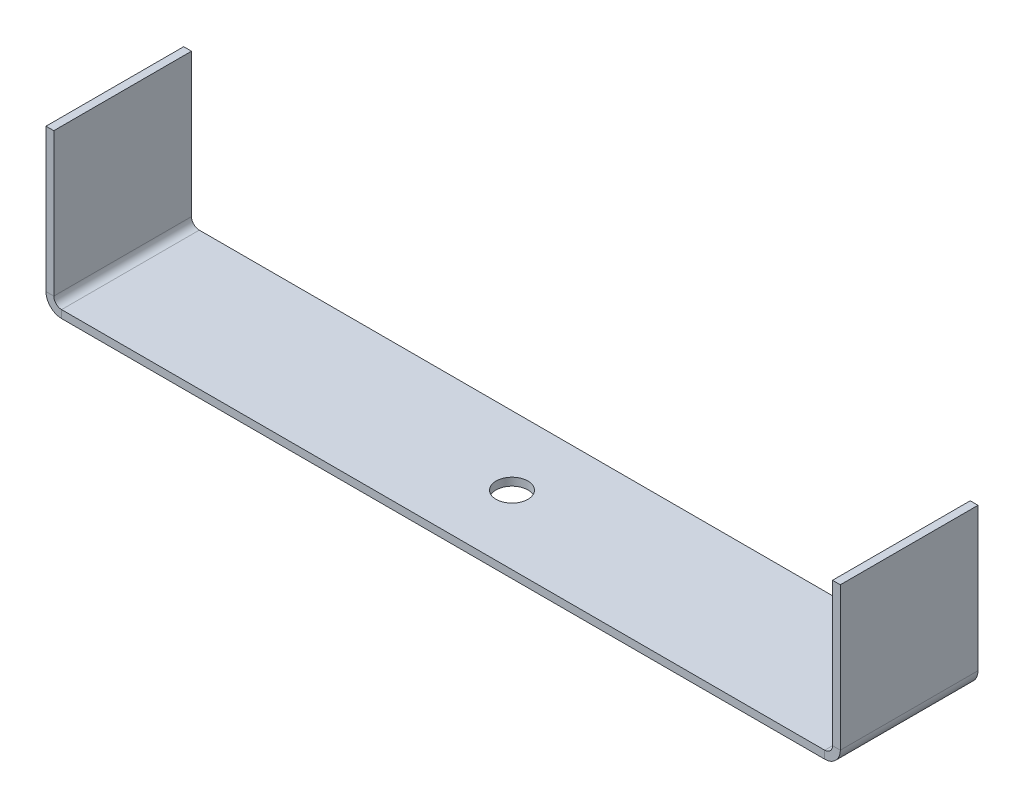
ISO-10303-21;
HEADER;
FILE_DESCRIPTION(('STEP AP214'),'2;1');
FILE_NAME('part.step','',(''),(''),'','','');
FILE_SCHEMA(('AUTOMOTIVE_DESIGN { 1 0 10303 214 1 1 1 1 }'));
ENDSEC;
DATA;
#1=APPLICATION_CONTEXT('core data for automotive mechanical design processes');
#2=APPLICATION_PROTOCOL_DEFINITION('international standard','automotive_design',2000,#1);
#3=PRODUCT_CONTEXT('',#1,'mechanical');
#4=PRODUCT('Part','Part','',(#3));
#5=PRODUCT_RELATED_PRODUCT_CATEGORY('part','',(#4));
#6=PRODUCT_DEFINITION_FORMATION('','',#4);
#7=PRODUCT_DEFINITION_CONTEXT('part definition',#1,'design');
#8=PRODUCT_DEFINITION('design','',#6,#7);
#9=PRODUCT_DEFINITION_SHAPE('','',#8);
#10=(LENGTH_UNIT() NAMED_UNIT(*) SI_UNIT(.MILLI.,.METRE.));
#11=(NAMED_UNIT(*) PLANE_ANGLE_UNIT() SI_UNIT($,.RADIAN.));
#12=(NAMED_UNIT(*) SI_UNIT($,.STERADIAN.) SOLID_ANGLE_UNIT());
#13=UNCERTAINTY_MEASURE_WITH_UNIT(LENGTH_MEASURE(1.E-05),#10,'distance_accuracy_value','');
#14=(GEOMETRIC_REPRESENTATION_CONTEXT(3) GLOBAL_UNCERTAINTY_ASSIGNED_CONTEXT((#13)) GLOBAL_UNIT_ASSIGNED_CONTEXT((#10,
#11,#12)) REPRESENTATION_CONTEXT('',''));
#15=CARTESIAN_POINT('',(0.,0.,0.));
#16=DIRECTION('',(0.,0.,1.));
#17=DIRECTION('',(1.,0.,0.));
#18=AXIS2_PLACEMENT_3D('',#15,#16,#17);
#19=CARTESIAN_POINT('',(36.0268,0.,6.5));
#20=DIRECTION('',(0.,0.,1.));
#21=DIRECTION('',(1.,0.,0.));
#22=AXIS2_PLACEMENT_3D('',#19,#20,#21);
#23=PLANE('',#22);
#24=DIRECTION('',(0.,1.,0.));
#25=VECTOR('',#24,1.);
#26=CARTESIAN_POINT('',(36.0268,0.,6.5));
#27=LINE('',#26,#25);
#28=CARTESIAN_POINT('',(36.0268,0.,6.5));
#29=VERTEX_POINT('',#28);
#30=CARTESIAN_POINT('',(36.0268,0.736600000000014,6.5));
#31=VERTEX_POINT('',#30);
#32=EDGE_CURVE('E11',#29,#31,#27,.T.);
#33=ORIENTED_EDGE('',*,*,#32,.F.);
#34=CARTESIAN_POINT('',(36.0268,1.47320000000001,6.5));
#35=DIRECTION('',(0.,0.,1.));
#36=DIRECTION('',(1.,0.,0.));
#37=AXIS2_PLACEMENT_3D('',#34,#35,#36);
#38=CIRCLE('',#37,1.4732);
#39=CARTESIAN_POINT('',(37.5,1.47320000000001,6.5));
#40=VERTEX_POINT('',#39);
#41=EDGE_CURVE('E247',#40,#29,#38,.F.);
#42=ORIENTED_EDGE('',*,*,#41,.F.);
#43=DIRECTION('',(1.,0.,0.));
#44=VECTOR('',#43,1.);
#45=CARTESIAN_POINT('',(36.7634,1.47320000000001,6.5));
#46=LINE('',#45,#44);
#47=CARTESIAN_POINT('',(36.7634,1.47320000000001,6.5));
#48=VERTEX_POINT('',#47);
#49=EDGE_CURVE('E44',#48,#40,#46,.T.);
#50=ORIENTED_EDGE('',*,*,#49,.F.);
#51=CARTESIAN_POINT('',(36.0268,1.47320000000001,6.5));
#52=DIRECTION('',(0.,0.,1.));
#53=DIRECTION('',(1.,0.,0.));
#54=AXIS2_PLACEMENT_3D('',#51,#52,#53);
#55=CIRCLE('',#54,0.7366);
#56=EDGE_CURVE('E145',#48,#31,#55,.F.);
#57=ORIENTED_EDGE('',*,*,#56,.T.);
#58=EDGE_LOOP('',(#33,#42,#50,#57));
#59=FACE_BOUND('',#58,.T.);
#60=ADVANCED_FACE('F36',(#59),#23,.T.);
#61=CARTESIAN_POINT('',(36.7634,1.47320000000001,6.5));
#62=DIRECTION('',(0.,0.,1.));
#63=DIRECTION('',(1.,0.,0.));
#64=AXIS2_PLACEMENT_3D('',#61,#62,#63);
#65=PLANE('',#64);
#66=DIRECTION('',(-1.,0.,0.));
#67=VECTOR('',#66,1.);
#68=CARTESIAN_POINT('',(-37.5,0.,6.5));
#69=LINE('',#68,#67);
#70=CARTESIAN_POINT('',(-36.0268,0.,6.5));
#71=VERTEX_POINT('',#70);
#72=EDGE_CURVE('E139',#29,#71,#69,.T.);
#73=ORIENTED_EDGE('',*,*,#72,.F.);
#74=ORIENTED_EDGE('',*,*,#32,.T.);
#75=DIRECTION('',(-1.,0.,0.));
#76=VECTOR('',#75,1.);
#77=CARTESIAN_POINT('',(-37.5,0.7366,6.5));
#78=LINE('',#77,#76);
#79=CARTESIAN_POINT('',(-36.0268,0.7366,6.5));
#80=VERTEX_POINT('',#79);
#81=EDGE_CURVE('E136',#31,#80,#78,.T.);
#82=ORIENTED_EDGE('',*,*,#81,.T.);
#83=DIRECTION('',(0.,-1.,0.));
#84=VECTOR('',#83,1.);
#85=CARTESIAN_POINT('',(-36.0268,0.7366,6.5));
#86=LINE('',#85,#84);
#87=EDGE_CURVE('E228',#80,#71,#86,.T.);
#88=ORIENTED_EDGE('',*,*,#87,.T.);
#89=EDGE_LOOP('',(#73,#74,#82,#88));
#90=FACE_BOUND('',#89,.T.);
#91=ADVANCED_FACE('F134',(#90),#65,.T.);
#92=CARTESIAN_POINT('',(37.5,1.47320000000001,-6.5));
#93=DIRECTION('',(0.,0.,-1.));
#94=DIRECTION('',(-1.,0.,0.));
#95=AXIS2_PLACEMENT_3D('',#92,#93,#94);
#96=PLANE('',#95);
#97=DIRECTION('',(-1.,0.,0.));
#98=VECTOR('',#97,1.);
#99=CARTESIAN_POINT('',(37.5,1.47320000000001,-6.5));
#100=LINE('',#99,#98);
#101=CARTESIAN_POINT('',(37.5,1.47320000000001,-6.5));
#102=VERTEX_POINT('',#101);
#103=CARTESIAN_POINT('',(36.7634,1.47320000000001,-6.5));
#104=VERTEX_POINT('',#103);
#105=EDGE_CURVE('E233',#102,#104,#100,.T.);
#106=ORIENTED_EDGE('',*,*,#105,.F.);
#107=CARTESIAN_POINT('',(36.0268,1.47320000000001,-6.5));
#108=DIRECTION('',(0.,0.,1.));
#109=DIRECTION('',(1.,0.,0.));
#110=AXIS2_PLACEMENT_3D('',#107,#108,#109);
#111=CIRCLE('',#110,1.4732);
#112=CARTESIAN_POINT('',(36.0268,0.,-6.5));
#113=VERTEX_POINT('',#112);
#114=EDGE_CURVE('E185',#102,#113,#111,.F.);
#115=ORIENTED_EDGE('',*,*,#114,.T.);
#116=DIRECTION('',(0.,-1.,0.));
#117=VECTOR('',#116,1.);
#118=CARTESIAN_POINT('',(36.0268,0.736600000000014,-6.5));
#119=LINE('',#118,#117);
#120=CARTESIAN_POINT('',(36.0268,0.736600000000014,-6.5));
#121=VERTEX_POINT('',#120);
#122=EDGE_CURVE('E231',#121,#113,#119,.T.);
#123=ORIENTED_EDGE('',*,*,#122,.F.);
#124=CARTESIAN_POINT('',(36.0268,1.47320000000001,-6.5));
#125=DIRECTION('',(0.,0.,1.));
#126=DIRECTION('',(1.,0.,0.));
#127=AXIS2_PLACEMENT_3D('',#124,#125,#126);
#128=CIRCLE('',#127,0.7366);
#129=EDGE_CURVE('E157',#104,#121,#128,.F.);
#130=ORIENTED_EDGE('',*,*,#129,.F.);
#131=EDGE_LOOP('',(#106,#115,#123,#130));
#132=FACE_BOUND('',#131,.T.);
#133=ADVANCED_FACE('F290',(#132),#96,.T.);
#134=CARTESIAN_POINT('',(36.0268,0.736600000000014,-6.5));
#135=DIRECTION('',(0.,0.,-1.));
#136=DIRECTION('',(-1.,0.,0.));
#137=AXIS2_PLACEMENT_3D('',#134,#135,#136);
#138=PLANE('',#137);
#139=DIRECTION('',(0.,-1.,0.));
#140=VECTOR('',#139,1.);
#141=CARTESIAN_POINT('',(37.5,0.,-6.5));
#142=LINE('',#141,#140);
#143=CARTESIAN_POINT('',(37.5,15.,-6.5));
#144=VERTEX_POINT('',#143);
#145=EDGE_CURVE('E188',#144,#102,#142,.T.);
#146=ORIENTED_EDGE('',*,*,#145,.T.);
#147=ORIENTED_EDGE('',*,*,#105,.T.);
#148=DIRECTION('',(0.,1.,0.));
#149=VECTOR('',#148,1.);
#150=CARTESIAN_POINT('',(36.7634,0.,-6.5));
#151=LINE('',#150,#149);
#152=CARTESIAN_POINT('',(36.7634,15.,-6.5));
#153=VERTEX_POINT('',#152);
#154=EDGE_CURVE('E194',#153,#104,#151,.F.);
#155=ORIENTED_EDGE('',*,*,#154,.F.);
#156=DIRECTION('',(1.,0.,0.));
#157=VECTOR('',#156,1.);
#158=CARTESIAN_POINT('',(36.7634,15.,-6.5));
#159=LINE('',#158,#157);
#160=EDGE_CURVE('E191',#153,#144,#159,.T.);
#161=ORIENTED_EDGE('',*,*,#160,.T.);
#162=EDGE_LOOP('',(#146,#147,#155,#161));
#163=FACE_BOUND('',#162,.T.);
#164=ADVANCED_FACE('F294',(#163),#138,.T.);
#165=CARTESIAN_POINT('',(-37.5,1.4732,6.5));
#166=DIRECTION('',(0.,0.,1.));
#167=DIRECTION('',(1.,0.,0.));
#168=AXIS2_PLACEMENT_3D('',#165,#166,#167);
#169=PLANE('',#168);
#170=DIRECTION('',(1.,0.,0.));
#171=VECTOR('',#170,1.);
#172=CARTESIAN_POINT('',(-37.5,1.4732,6.5));
#173=LINE('',#172,#171);
#174=CARTESIAN_POINT('',(-37.5,1.4732,6.5));
#175=VERTEX_POINT('',#174);
#176=CARTESIAN_POINT('',(-36.7634,1.4732,6.5));
#177=VERTEX_POINT('',#176);
#178=EDGE_CURVE('E52',#175,#177,#173,.T.);
#179=ORIENTED_EDGE('',*,*,#178,.F.);
#180=CARTESIAN_POINT('',(-36.0268,1.4732,6.5));
#181=DIRECTION('',(0.,0.,1.));
#182=DIRECTION('',(1.,0.,0.));
#183=AXIS2_PLACEMENT_3D('',#180,#181,#182);
#184=CIRCLE('',#183,1.4732);
#185=EDGE_CURVE('E257',#71,#175,#184,.F.);
#186=ORIENTED_EDGE('',*,*,#185,.F.);
#187=ORIENTED_EDGE('',*,*,#87,.F.);
#188=CARTESIAN_POINT('',(-36.0268,1.4732,6.5));
#189=DIRECTION('',(0.,0.,1.));
#190=DIRECTION('',(1.,0.,0.));
#191=AXIS2_PLACEMENT_3D('',#188,#189,#190);
#192=CIRCLE('',#191,0.7366);
#193=EDGE_CURVE('E165',#80,#177,#192,.F.);
#194=ORIENTED_EDGE('',*,*,#193,.T.);
#195=EDGE_LOOP('',(#179,#186,#187,#194));
#196=FACE_BOUND('',#195,.T.);
#197=ADVANCED_FACE('F300',(#196),#169,.T.);
#198=CARTESIAN_POINT('',(-36.0268,0.7366,6.5));
#199=DIRECTION('',(0.,0.,1.));
#200=DIRECTION('',(1.,0.,0.));
#201=AXIS2_PLACEMENT_3D('',#198,#199,#200);
#202=PLANE('',#201);
#203=DIRECTION('',(0.,1.,0.));
#204=VECTOR('',#203,1.);
#205=CARTESIAN_POINT('',(-37.5,0.,6.5));
#206=LINE('',#205,#204);
#207=CARTESIAN_POINT('',(-37.5,15.,6.5));
#208=VERTEX_POINT('',#207);
#209=EDGE_CURVE('E260',#175,#208,#206,.T.);
#210=ORIENTED_EDGE('',*,*,#209,.F.);
#211=ORIENTED_EDGE('',*,*,#178,.T.);
#212=DIRECTION('',(0.,1.,0.));
#213=VECTOR('',#212,1.);
#214=CARTESIAN_POINT('',(-36.7634,0.,6.5));
#215=LINE('',#214,#213);
#216=CARTESIAN_POINT('',(-36.7634,15.,6.5));
#217=VERTEX_POINT('',#216);
#218=EDGE_CURVE('E106',#177,#217,#215,.T.);
#219=ORIENTED_EDGE('',*,*,#218,.T.);
#220=DIRECTION('',(1.,0.,0.));
#221=VECTOR('',#220,1.);
#222=CARTESIAN_POINT('',(-37.5,15.,6.5));
#223=LINE('',#222,#221);
#224=EDGE_CURVE('E263',#208,#217,#223,.T.);
#225=ORIENTED_EDGE('',*,*,#224,.F.);
#226=EDGE_LOOP('',(#210,#211,#219,#225));
#227=FACE_BOUND('',#226,.T.);
#228=ADVANCED_FACE('F304',(#227),#202,.T.);
#229=CARTESIAN_POINT('',(-36.0268,0.,-6.5));
#230=DIRECTION('',(0.,0.,-1.));
#231=DIRECTION('',(-1.,0.,0.));
#232=AXIS2_PLACEMENT_3D('',#229,#230,#231);
#233=PLANE('',#232);
#234=DIRECTION('',(0.,1.,0.));
#235=VECTOR('',#234,1.);
#236=CARTESIAN_POINT('',(-36.0268,0.,-6.5));
#237=LINE('',#236,#235);
#238=CARTESIAN_POINT('',(-36.0268,0.,-6.5));
#239=VERTEX_POINT('',#238);
#240=CARTESIAN_POINT('',(-36.0268,0.7366,-6.5));
#241=VERTEX_POINT('',#240);
#242=EDGE_CURVE('E93',#239,#241,#237,.T.);
#243=ORIENTED_EDGE('',*,*,#242,.F.);
#244=CARTESIAN_POINT('',(-36.0268,1.4732,-6.5));
#245=DIRECTION('',(0.,0.,1.));
#246=DIRECTION('',(1.,0.,0.));
#247=AXIS2_PLACEMENT_3D('',#244,#245,#246);
#248=CIRCLE('',#247,1.4732);
#249=CARTESIAN_POINT('',(-37.5,1.4732,-6.5));
#250=VERTEX_POINT('',#249);
#251=EDGE_CURVE('E181',#239,#250,#248,.F.);
#252=ORIENTED_EDGE('',*,*,#251,.T.);
#253=DIRECTION('',(-1.,0.,0.));
#254=VECTOR('',#253,1.);
#255=CARTESIAN_POINT('',(-36.7634,1.4732,-6.5));
#256=LINE('',#255,#254);
#257=CARTESIAN_POINT('',(-36.7634,1.4732,-6.5));
#258=VERTEX_POINT('',#257);
#259=EDGE_CURVE('E100',#258,#250,#256,.T.);
#260=ORIENTED_EDGE('',*,*,#259,.F.);
#261=CARTESIAN_POINT('',(-36.0268,1.4732,-6.5));
#262=DIRECTION('',(0.,0.,1.));
#263=DIRECTION('',(1.,0.,0.));
#264=AXIS2_PLACEMENT_3D('',#261,#262,#263);
#265=CIRCLE('',#264,0.7366);
#266=EDGE_CURVE('E200',#241,#258,#265,.F.);
#267=ORIENTED_EDGE('',*,*,#266,.F.);
#268=EDGE_LOOP('',(#243,#252,#260,#267));
#269=FACE_BOUND('',#268,.T.);
#270=ADVANCED_FACE('F308',(#269),#233,.T.);
#271=CARTESIAN_POINT('',(-36.7634,1.4732,-6.5));
#272=DIRECTION('',(0.,0.,-1.));
#273=DIRECTION('',(-1.,0.,0.));
#274=AXIS2_PLACEMENT_3D('',#271,#272,#273);
#275=PLANE('',#274);
#276=DIRECTION('',(-1.,0.,0.));
#277=VECTOR('',#276,1.);
#278=CARTESIAN_POINT('',(-37.5,0.,-6.5));
#279=LINE('',#278,#277);
#280=EDGE_CURVE('E183',#113,#239,#279,.T.);
#281=ORIENTED_EDGE('',*,*,#280,.T.);
#282=ORIENTED_EDGE('',*,*,#242,.T.);
#283=DIRECTION('',(-1.,0.,0.));
#284=VECTOR('',#283,1.);
#285=CARTESIAN_POINT('',(-37.5,0.7366,-6.5));
#286=LINE('',#285,#284);
#287=EDGE_CURVE('E198',#121,#241,#286,.T.);
#288=ORIENTED_EDGE('',*,*,#287,.F.);
#289=ORIENTED_EDGE('',*,*,#122,.T.);
#290=EDGE_LOOP('',(#281,#282,#288,#289));
#291=FACE_BOUND('',#290,.T.);
#292=ADVANCED_FACE('F311',(#291),#275,.T.);
#293=CARTESIAN_POINT('',(-36.7634,0.,6.5));
#294=DIRECTION('',(-1.,0.,0.));
#295=DIRECTION('',(0.,0.,1.));
#296=AXIS2_PLACEMENT_3D('',#293,#294,#295);
#297=PLANE('',#296);
#298=DIRECTION('',(0.,1.,0.));
#299=VECTOR('',#298,1.);
#300=CARTESIAN_POINT('',(-36.7634,0.,-6.5));
#301=LINE('',#300,#299);
#302=CARTESIAN_POINT('',(-36.7634,15.,-6.5));
#303=VERTEX_POINT('',#302);
#304=EDGE_CURVE('E171',#258,#303,#301,.T.);
#305=ORIENTED_EDGE('',*,*,#304,.T.);
#306=DIRECTION('',(0.,0.,-1.));
#307=VECTOR('',#306,1.);
#308=CARTESIAN_POINT('',(-36.7634,15.,6.5));
#309=LINE('',#308,#307);
#310=EDGE_CURVE('E224',#217,#303,#309,.T.);
#311=ORIENTED_EDGE('',*,*,#310,.F.);
#312=ORIENTED_EDGE('',*,*,#218,.F.);
#313=DIRECTION('',(0.,0.,-1.));
#314=VECTOR('',#313,1.);
#315=CARTESIAN_POINT('',(-36.7634,1.4732,6.5));
#316=LINE('',#315,#314);
#317=EDGE_CURVE('E167',#177,#258,#316,.T.);
#318=ORIENTED_EDGE('',*,*,#317,.T.);
#319=EDGE_LOOP('',(#305,#311,#312,#318));
#320=FACE_BOUND('',#319,.T.);
#321=ADVANCED_FACE('F314',(#320),#297,.F.);
#322=CARTESIAN_POINT('',(-37.5,15.,6.5));
#323=DIRECTION('',(0.,1.,0.));
#324=DIRECTION('',(0.,0.,1.));
#325=AXIS2_PLACEMENT_3D('',#322,#323,#324);
#326=PLANE('',#325);
#327=DIRECTION('',(1.,0.,0.));
#328=VECTOR('',#327,1.);
#329=CARTESIAN_POINT('',(-37.5,15.,-6.5));
#330=LINE('',#329,#328);
#331=CARTESIAN_POINT('',(-37.5,15.,-6.5));
#332=VERTEX_POINT('',#331);
#333=EDGE_CURVE('E174',#332,#303,#330,.T.);
#334=ORIENTED_EDGE('',*,*,#333,.F.);
#335=DIRECTION('',(0.,0.,-1.));
#336=VECTOR('',#335,1.);
#337=CARTESIAN_POINT('',(-37.5,15.,6.5));
#338=LINE('',#337,#336);
#339=EDGE_CURVE('E222',#208,#332,#338,.T.);
#340=ORIENTED_EDGE('',*,*,#339,.F.);
#341=ORIENTED_EDGE('',*,*,#224,.T.);
#342=ORIENTED_EDGE('',*,*,#310,.T.);
#343=EDGE_LOOP('',(#334,#340,#341,#342));
#344=FACE_BOUND('',#343,.T.);
#345=ADVANCED_FACE('F317',(#344),#326,.T.);
#346=CARTESIAN_POINT('',(-37.5,0.,6.5));
#347=DIRECTION('',(-1.,0.,0.));
#348=DIRECTION('',(0.,0.,1.));
#349=AXIS2_PLACEMENT_3D('',#346,#347,#348);
#350=PLANE('',#349);
#351=DIRECTION('',(0.,1.,0.));
#352=VECTOR('',#351,1.);
#353=CARTESIAN_POINT('',(-37.5,0.,-6.5));
#354=LINE('',#353,#352);
#355=EDGE_CURVE('E178',#250,#332,#354,.T.);
#356=ORIENTED_EDGE('',*,*,#355,.F.);
#357=DIRECTION('',(0.,0.,-1.));
#358=VECTOR('',#357,1.);
#359=CARTESIAN_POINT('',(-37.5,1.4732,6.5));
#360=LINE('',#359,#358);
#361=EDGE_CURVE('E219',#175,#250,#360,.T.);
#362=ORIENTED_EDGE('',*,*,#361,.F.);
#363=ORIENTED_EDGE('',*,*,#209,.T.);
#364=ORIENTED_EDGE('',*,*,#339,.T.);
#365=EDGE_LOOP('',(#356,#362,#363,#364));
#366=FACE_BOUND('',#365,.T.);
#367=ADVANCED_FACE('F321',(#366),#350,.T.);
#368=CARTESIAN_POINT('',(-36.0268,1.4732,6.5));
#369=DIRECTION('',(0.,0.,-1.));
#370=DIRECTION('',(-1.,0.,0.));
#371=AXIS2_PLACEMENT_3D('',#368,#369,#370);
#372=CYLINDRICAL_SURFACE('',#371,1.4732);
#373=ORIENTED_EDGE('',*,*,#251,.F.);
#374=DIRECTION('',(0.,0.,-1.));
#375=VECTOR('',#374,1.);
#376=CARTESIAN_POINT('',(-36.0268,0.,6.5));
#377=LINE('',#376,#375);
#378=EDGE_CURVE('E216',#71,#239,#377,.T.);
#379=ORIENTED_EDGE('',*,*,#378,.F.);
#380=ORIENTED_EDGE('',*,*,#185,.T.);
#381=ORIENTED_EDGE('',*,*,#361,.T.);
#382=EDGE_LOOP('',(#373,#379,#380,#381));
#383=FACE_BOUND('',#382,.T.);
#384=ADVANCED_FACE('F325',(#383),#372,.T.);
#385=CARTESIAN_POINT('',(-37.5,0.,6.5));
#386=DIRECTION('',(0.,-1.,0.));
#387=DIRECTION('',(1.,0.,0.));
#388=AXIS2_PLACEMENT_3D('',#385,#386,#387);
#389=PLANE('',#388);
#390=CARTESIAN_POINT('',(0.,0.,0.));
#391=DIRECTION('',(0.,-1.,0.));
#392=DIRECTION('',(1.,0.,0.));
#393=AXIS2_PLACEMENT_3D('',#390,#391,#392);
#394=CIRCLE('',#393,1.5);
#395=CARTESIAN_POINT('',(1.5,0.,0.));
#396=VERTEX_POINT('',#395);
#397=EDGE_CURVE('E267',#396,#396,#394,.F.);
#398=ORIENTED_EDGE('',*,*,#397,.T.);
#399=EDGE_LOOP('',(#398));
#400=FACE_BOUND('',#399,.T.);
#401=ORIENTED_EDGE('',*,*,#280,.F.);
#402=DIRECTION('',(0.,0.,-1.));
#403=VECTOR('',#402,1.);
#404=CARTESIAN_POINT('',(36.0268,0.,6.5));
#405=LINE('',#404,#403);
#406=EDGE_CURVE('E213',#29,#113,#405,.T.);
#407=ORIENTED_EDGE('',*,*,#406,.F.);
#408=ORIENTED_EDGE('',*,*,#72,.T.);
#409=ORIENTED_EDGE('',*,*,#378,.T.);
#410=EDGE_LOOP('',(#401,#407,#408,#409));
#411=FACE_BOUND('',#410,.T.);
#412=ADVANCED_FACE('F329',(#400,#411),#389,.T.);
#413=CARTESIAN_POINT('',(36.0268,1.47320000000001,6.5));
#414=DIRECTION('',(0.,0.,-1.));
#415=DIRECTION('',(-1.,0.,0.));
#416=AXIS2_PLACEMENT_3D('',#413,#414,#415);
#417=CYLINDRICAL_SURFACE('',#416,1.4732);
#418=ORIENTED_EDGE('',*,*,#114,.F.);
#419=DIRECTION('',(0.,0.,-1.));
#420=VECTOR('',#419,1.);
#421=CARTESIAN_POINT('',(37.5,1.47320000000001,6.5));
#422=LINE('',#421,#420);
#423=EDGE_CURVE('E210',#40,#102,#422,.T.);
#424=ORIENTED_EDGE('',*,*,#423,.F.);
#425=ORIENTED_EDGE('',*,*,#41,.T.);
#426=ORIENTED_EDGE('',*,*,#406,.T.);
#427=EDGE_LOOP('',(#418,#424,#425,#426));
#428=FACE_BOUND('',#427,.T.);
#429=ADVANCED_FACE('F246',(#428),#417,.T.);
#430=CARTESIAN_POINT('',(37.5,0.,6.5));
#431=DIRECTION('',(1.,0.,0.));
#432=DIRECTION('',(0.,0.,-1.));
#433=AXIS2_PLACEMENT_3D('',#430,#431,#432);
#434=PLANE('',#433);
#435=ORIENTED_EDGE('',*,*,#145,.F.);
#436=DIRECTION('',(0.,0.,-1.));
#437=VECTOR('',#436,1.);
#438=CARTESIAN_POINT('',(37.5,15.,6.5));
#439=LINE('',#438,#437);
#440=CARTESIAN_POINT('',(37.5,15.,6.5));
#441=VERTEX_POINT('',#440);
#442=EDGE_CURVE('E208',#441,#144,#439,.T.);
#443=ORIENTED_EDGE('',*,*,#442,.F.);
#444=DIRECTION('',(0.,-1.,0.));
#445=VECTOR('',#444,1.);
#446=CARTESIAN_POINT('',(37.5,0.,6.5));
#447=LINE('',#446,#445);
#448=EDGE_CURVE('E240',#441,#40,#447,.T.);
#449=ORIENTED_EDGE('',*,*,#448,.T.);
#450=ORIENTED_EDGE('',*,*,#423,.T.);
#451=EDGE_LOOP('',(#435,#443,#449,#450));
#452=FACE_BOUND('',#451,.T.);
#453=ADVANCED_FACE('F251',(#452),#434,.T.);
#454=CARTESIAN_POINT('',(36.7634,15.,6.5));
#455=DIRECTION('',(0.,1.,0.));
#456=DIRECTION('',(0.,0.,1.));
#457=AXIS2_PLACEMENT_3D('',#454,#455,#456);
#458=PLANE('',#457);
#459=ORIENTED_EDGE('',*,*,#160,.F.);
#460=DIRECTION('',(0.,0.,-1.));
#461=VECTOR('',#460,1.);
#462=CARTESIAN_POINT('',(36.7634,15.,6.5));
#463=LINE('',#462,#461);
#464=CARTESIAN_POINT('',(36.7634,15.,6.5));
#465=VERTEX_POINT('',#464);
#466=EDGE_CURVE('E206',#465,#153,#463,.T.);
#467=ORIENTED_EDGE('',*,*,#466,.F.);
#468=DIRECTION('',(1.,0.,0.));
#469=VECTOR('',#468,1.);
#470=CARTESIAN_POINT('',(36.7634,15.,6.5));
#471=LINE('',#470,#469);
#472=EDGE_CURVE('E252',#465,#441,#471,.T.);
#473=ORIENTED_EDGE('',*,*,#472,.T.);
#474=ORIENTED_EDGE('',*,*,#442,.T.);
#475=EDGE_LOOP('',(#459,#467,#473,#474));
#476=FACE_BOUND('',#475,.T.);
#477=ADVANCED_FACE('F338',(#476),#458,.T.);
#478=CARTESIAN_POINT('',(36.7634,0.,6.5));
#479=DIRECTION('',(1.,0.,0.));
#480=DIRECTION('',(0.,0.,-1.));
#481=AXIS2_PLACEMENT_3D('',#478,#479,#480);
#482=PLANE('',#481);
#483=ORIENTED_EDGE('',*,*,#154,.T.);
#484=DIRECTION('',(0.,0.,-1.));
#485=VECTOR('',#484,1.);
#486=CARTESIAN_POINT('',(36.7634,1.47320000000001,6.5));
#487=LINE('',#486,#485);
#488=EDGE_CURVE('E159',#48,#104,#487,.T.);
#489=ORIENTED_EDGE('',*,*,#488,.F.);
#490=DIRECTION('',(0.,1.,0.));
#491=VECTOR('',#490,1.);
#492=CARTESIAN_POINT('',(36.7634,0.,6.5));
#493=LINE('',#492,#491);
#494=EDGE_CURVE('E150',#465,#48,#493,.F.);
#495=ORIENTED_EDGE('',*,*,#494,.F.);
#496=ORIENTED_EDGE('',*,*,#466,.T.);
#497=EDGE_LOOP('',(#483,#489,#495,#496));
#498=FACE_BOUND('',#497,.T.);
#499=ADVANCED_FACE('F284',(#498),#482,.F.);
#500=CARTESIAN_POINT('',(36.0268,1.47320000000001,6.5));
#501=DIRECTION('',(0.,0.,-1.));
#502=DIRECTION('',(-1.,0.,0.));
#503=AXIS2_PLACEMENT_3D('',#500,#501,#502);
#504=CYLINDRICAL_SURFACE('',#503,0.7366);
#505=ORIENTED_EDGE('',*,*,#129,.T.);
#506=DIRECTION('',(0.,0.,-1.));
#507=VECTOR('',#506,1.);
#508=CARTESIAN_POINT('',(36.0268,0.736600000000014,6.5));
#509=LINE('',#508,#507);
#510=EDGE_CURVE('E154',#31,#121,#509,.T.);
#511=ORIENTED_EDGE('',*,*,#510,.F.);
#512=ORIENTED_EDGE('',*,*,#56,.F.);
#513=ORIENTED_EDGE('',*,*,#488,.T.);
#514=EDGE_LOOP('',(#505,#511,#512,#513));
#515=FACE_BOUND('',#514,.T.);
#516=ADVANCED_FACE('F155',(#515),#504,.F.);
#517=CARTESIAN_POINT('',(-37.5,0.7366,6.5));
#518=DIRECTION('',(0.,-1.,0.));
#519=DIRECTION('',(1.,0.,0.));
#520=AXIS2_PLACEMENT_3D('',#517,#518,#519);
#521=PLANE('',#520);
#522=CARTESIAN_POINT('',(0.,0.736600000000007,0.));
#523=DIRECTION('',(0.,1.,0.));
#524=DIRECTION('',(-1.,0.,0.));
#525=AXIS2_PLACEMENT_3D('',#522,#523,#524);
#526=CIRCLE('',#525,1.5);
#527=CARTESIAN_POINT('',(-1.5,0.736600000000007,0.));
#528=VERTEX_POINT('',#527);
#529=EDGE_CURVE('E175',#528,#528,#526,.T.);
#530=ORIENTED_EDGE('',*,*,#529,.F.);
#531=EDGE_LOOP('',(#530));
#532=FACE_BOUND('',#531,.T.);
#533=ORIENTED_EDGE('',*,*,#287,.T.);
#534=DIRECTION('',(0.,0.,-1.));
#535=VECTOR('',#534,1.);
#536=CARTESIAN_POINT('',(-36.0268,0.7366,6.5));
#537=LINE('',#536,#535);
#538=EDGE_CURVE('E160',#80,#241,#537,.T.);
#539=ORIENTED_EDGE('',*,*,#538,.F.);
#540=ORIENTED_EDGE('',*,*,#81,.F.);
#541=ORIENTED_EDGE('',*,*,#510,.T.);
#542=EDGE_LOOP('',(#533,#539,#540,#541));
#543=FACE_BOUND('',#542,.T.);
#544=ADVANCED_FACE('F162',(#532,#543),#521,.F.);
#545=CARTESIAN_POINT('',(-36.0268,1.4732,6.5));
#546=DIRECTION('',(0.,0.,-1.));
#547=DIRECTION('',(-1.,0.,0.));
#548=AXIS2_PLACEMENT_3D('',#545,#546,#547);
#549=CYLINDRICAL_SURFACE('',#548,0.7366);
#550=ORIENTED_EDGE('',*,*,#266,.T.);
#551=ORIENTED_EDGE('',*,*,#317,.F.);
#552=ORIENTED_EDGE('',*,*,#193,.F.);
#553=ORIENTED_EDGE('',*,*,#538,.T.);
#554=EDGE_LOOP('',(#550,#551,#552,#553));
#555=FACE_BOUND('',#554,.T.);
#556=ADVANCED_FACE('F276',(#555),#549,.F.);
#557=CARTESIAN_POINT('',(-36.0268,1.4732,6.5));
#558=DIRECTION('',(0.,0.,1.));
#559=DIRECTION('',(1.,0.,0.));
#560=AXIS2_PLACEMENT_3D('',#557,#558,#559);
#561=PLANE('',#560);
#562=ORIENTED_EDGE('',*,*,#494,.T.);
#563=ORIENTED_EDGE('',*,*,#49,.T.);
#564=ORIENTED_EDGE('',*,*,#448,.F.);
#565=ORIENTED_EDGE('',*,*,#472,.F.);
#566=EDGE_LOOP('',(#562,#563,#564,#565));
#567=FACE_BOUND('',#566,.T.);
#568=ADVANCED_FACE('F237',(#567),#561,.T.);
#569=CARTESIAN_POINT('',(-36.0268,1.4732,-6.5));
#570=DIRECTION('',(0.,0.,1.));
#571=DIRECTION('',(1.,0.,0.));
#572=AXIS2_PLACEMENT_3D('',#569,#570,#571);
#573=PLANE('',#572);
#574=ORIENTED_EDGE('',*,*,#304,.F.);
#575=ORIENTED_EDGE('',*,*,#259,.T.);
#576=ORIENTED_EDGE('',*,*,#355,.T.);
#577=ORIENTED_EDGE('',*,*,#333,.T.);
#578=EDGE_LOOP('',(#574,#575,#576,#577));
#579=FACE_BOUND('',#578,.T.);
#580=ADVANCED_FACE('F358',(#579),#573,.F.);
#581=CARTESIAN_POINT('',(0.,-0.00100000000000664,0.));
#582=DIRECTION('',(0.,1.,0.));
#583=DIRECTION('',(-1.,0.,0.));
#584=AXIS2_PLACEMENT_3D('',#581,#582,#583);
#585=CYLINDRICAL_SURFACE('',#584,1.5);
#586=ORIENTED_EDGE('',*,*,#397,.F.);
#587=EDGE_LOOP('',(#586));
#588=FACE_BOUND('',#587,.T.);
#589=ORIENTED_EDGE('',*,*,#529,.T.);
#590=EDGE_LOOP('',(#589));
#591=FACE_BOUND('',#590,.T.);
#592=ADVANCED_FACE('F273',(#588,#591),#585,.F.);
#593=CLOSED_SHELL('',(#60,#91,#133,#164,#197,#228,#270,#292,#321,#345,#367,#384,#412,#429,#453,
#477,#499,#516,#544,#556,#568,#580,#592));
#594=MANIFOLD_SOLID_BREP('B2',#593);
#595=ADVANCED_BREP_SHAPE_REPRESENTATION('',(#18,#594),#14);
#596=SHAPE_DEFINITION_REPRESENTATION(#9,#595);
ENDSEC;
END-ISO-10303-21;
